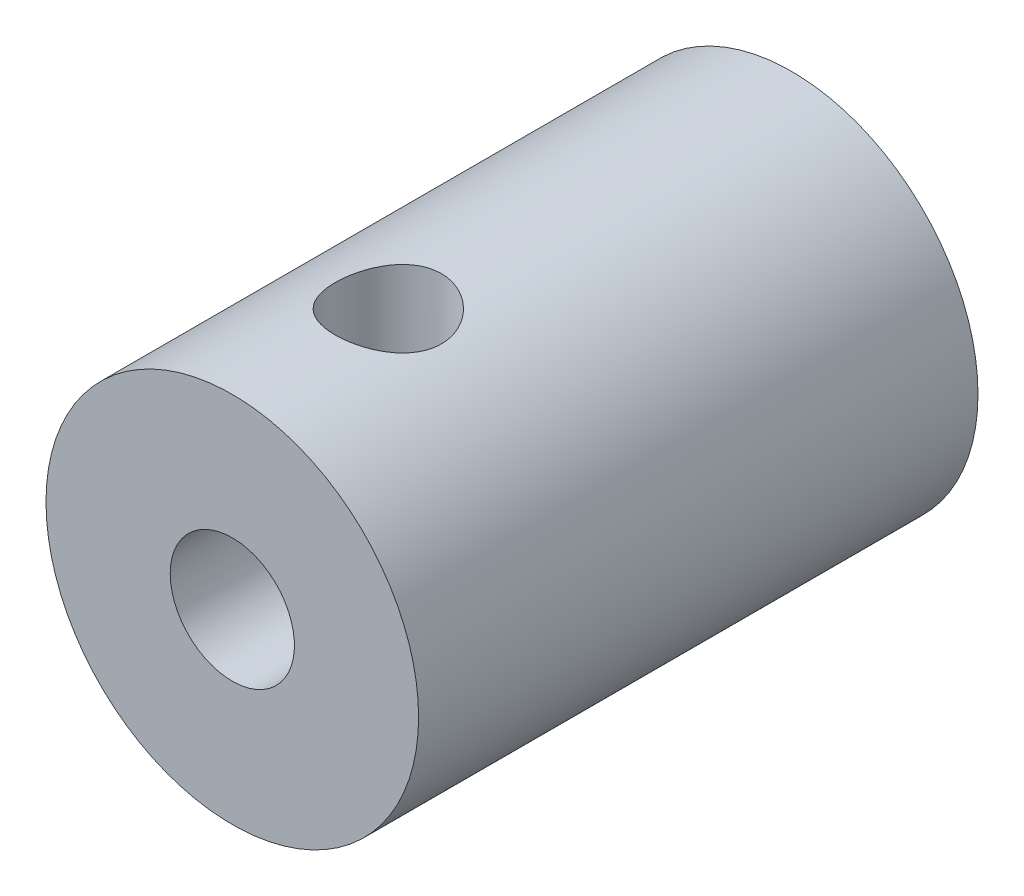
ISO-10303-21;
HEADER;
FILE_DESCRIPTION(('STEP AP214'),'2;1');
FILE_NAME('part.step','',(''),(''),'','','');
FILE_SCHEMA(('AUTOMOTIVE_DESIGN { 1 0 10303 214 1 1 1 1 }'));
ENDSEC;
DATA;
#1=APPLICATION_CONTEXT('core data for automotive mechanical design processes');
#2=APPLICATION_PROTOCOL_DEFINITION('international standard','automotive_design',2000,#1);
#3=PRODUCT_CONTEXT('',#1,'mechanical');
#4=PRODUCT('Part','Part','',(#3));
#5=PRODUCT_RELATED_PRODUCT_CATEGORY('part','',(#4));
#6=PRODUCT_DEFINITION_FORMATION('','',#4);
#7=PRODUCT_DEFINITION_CONTEXT('part definition',#1,'design');
#8=PRODUCT_DEFINITION('design','',#6,#7);
#9=PRODUCT_DEFINITION_SHAPE('','',#8);
#10=(LENGTH_UNIT() NAMED_UNIT(*) SI_UNIT(.MILLI.,.METRE.));
#11=(NAMED_UNIT(*) PLANE_ANGLE_UNIT() SI_UNIT($,.RADIAN.));
#12=(NAMED_UNIT(*) SI_UNIT($,.STERADIAN.) SOLID_ANGLE_UNIT());
#13=UNCERTAINTY_MEASURE_WITH_UNIT(LENGTH_MEASURE(1.E-05),#10,'distance_accuracy_value','');
#14=(GEOMETRIC_REPRESENTATION_CONTEXT(3) GLOBAL_UNCERTAINTY_ASSIGNED_CONTEXT((#13)) GLOBAL_UNIT_ASSIGNED_CONTEXT((#10,
#11,#12)) REPRESENTATION_CONTEXT('',''));
#15=CARTESIAN_POINT('',(0.,0.,0.));
#16=DIRECTION('',(0.,0.,1.));
#17=DIRECTION('',(1.,0.,0.));
#18=AXIS2_PLACEMENT_3D('',#15,#16,#17);
#19=CARTESIAN_POINT('',(0.,0.,14.3002));
#20=DIRECTION('',(0.,0.,-1.));
#21=DIRECTION('',(-1.,0.,0.));
#22=AXIS2_PLACEMENT_3D('',#19,#20,#21);
#23=CYLINDRICAL_SURFACE('',#22,1.5875);
#24=CARTESIAN_POINT('',(0.,-1.5875,11.6713));
#25=CARTESIAN_POINT('',(-0.0640084504905558,-1.58749589459133,11.6712958127309));
#26=CARTESIAN_POINT('',(-0.128052378170848,-1.58359361221242,11.6667427239407));
#27=CARTESIAN_POINT('',(-0.254004444384052,-1.56833557661519,11.6488693187214));
#28=CARTESIAN_POINT('',(-0.31591034239439,-1.55697224007382,11.6355400822862));
#29=CARTESIAN_POINT('',(-0.43545788852067,-1.52784070258027,11.6011333320459));
#30=CARTESIAN_POINT('',(-0.493123421246892,-1.51011232303287,11.5801039763453));
#31=CARTESIAN_POINT('',(-0.603563016370308,-1.46946883255929,11.5314038275147));
#32=CARTESIAN_POINT('',(-0.65633553057509,-1.44655208783111,11.5037309421891));
#33=CARTESIAN_POINT('',(-0.775479643972469,-1.38734547457949,11.431228393187));
#34=CARTESIAN_POINT('',(-0.839430121361419,-1.34927820132004,11.3838705313084));
#35=CARTESIAN_POINT('',(-0.956827927030479,-1.26875200121344,11.2805112899162));
#36=CARTESIAN_POINT('',(-1.01024616623841,-1.22628139243691,11.2244867137964));
#37=CARTESIAN_POINT('',(-1.10756916055087,-1.13919610828915,11.1036329469231));
#38=CARTESIAN_POINT('',(-1.15125855043728,-1.09455540189057,11.038647982042));
#39=CARTESIAN_POINT('',(-1.20839293207449,-1.02994020129173,10.9352453305035));
#40=CARTESIAN_POINT('',(-1.22602936162688,-1.00880526960526,10.8998142641661));
#41=CARTESIAN_POINT('',(-1.25840811877496,-0.968110362824358,10.8268057058711));
#42=CARTESIAN_POINT('',(-1.27315278956988,-0.948549120210561,10.7892299838775));
#43=CARTESIAN_POINT('',(-1.30030535020041,-0.911004554982558,10.7095011315517));
#44=CARTESIAN_POINT('',(-1.31252904950507,-0.893177658887615,10.6672089693406));
#45=CARTESIAN_POINT('',(-1.3330336869221,-0.862277496051067,10.5800335348547));
#46=CARTESIAN_POINT('',(-1.34132279892616,-0.849194387826297,10.5351558534305));
#47=CARTESIAN_POINT('',(-1.35346399193291,-0.829718778233447,10.4425763800295));
#48=CARTESIAN_POINT('',(-1.35724831461928,-0.823428578671972,10.3948425336665));
#49=CARTESIAN_POINT('',(-1.35967715414612,-0.819416815431586,10.2988983855038));
#50=CARTESIAN_POINT('',(-1.35832678712271,-0.821686722558324,10.2506886056781));
#51=CARTESIAN_POINT('',(-1.3512739801,-0.833213054748677,10.1630454067824));
#52=CARTESIAN_POINT('',(-1.34626586930141,-0.841352481635303,10.1233938189834));
#53=CARTESIAN_POINT('',(-1.3330747561935,-0.862102484627274,10.0458069526178));
#54=CARTESIAN_POINT('',(-1.32488626617737,-0.874720785718706,10.007874767888));
#55=CARTESIAN_POINT('',(-1.29777622467968,-0.91481806217253,9.90342216849849));
#56=CARTESIAN_POINT('',(-1.27557728239548,-0.945959990673267,9.8391840292266));
#57=CARTESIAN_POINT('',(-1.22317046070292,-1.01283679367527,9.7166460783179));
#58=CARTESIAN_POINT('',(-1.19293820130944,-1.04858547600138,9.65836510420953));
#59=CARTESIAN_POINT('',(-1.12216109506704,-1.12419073896514,9.54278538980588));
#60=CARTESIAN_POINT('',(-1.08098529702561,-1.16414732702571,9.48593715593545));
#61=CARTESIAN_POINT('',(-0.989845756287439,-1.2425690540304,9.37872205247443));
#62=CARTESIAN_POINT('',(-0.939892243937295,-1.28103586628618,9.3283477546308));
#63=CARTESIAN_POINT('',(-0.834150799346787,-1.35210097812726,9.23751445515691));
#64=CARTESIAN_POINT('',(-0.778849609273434,-1.38490773733558,9.19665692022532));
#65=CARTESIAN_POINT('',(-0.660526806227747,-1.44507822711164,9.12279442899352));
#66=CARTESIAN_POINT('',(-0.597512689657164,-1.47244717600585,9.08978193827052));
#67=CARTESIAN_POINT('',(-0.476303309747889,-1.5154778394623,9.03831708605576));
#68=CARTESIAN_POINT('',(-0.419195857618796,-1.53235030667584,9.01832748246568));
#69=CARTESIAN_POINT('',(-0.301411762969124,-1.55979290959103,8.98594556501144));
#70=CARTESIAN_POINT('',(-0.240737764634567,-1.57036765117261,8.97354769869642));
#71=CARTESIAN_POINT('',(-0.117156057800018,-1.58439653382545,8.95711999102989));
#72=CARTESIAN_POINT('',(-0.0542395964092401,-1.58781871755521,8.95312770489127));
#73=CARTESIAN_POINT('',(0.0714976367282692,-1.58713437817949,8.95392708996004));
#74=CARTESIAN_POINT('',(0.134318410856156,-1.58302804558713,8.95871853889035));
#75=CARTESIAN_POINT('',(0.253393528607964,-1.56821346156491,8.97607493754793));
#76=CARTESIAN_POINT('',(0.309796808389616,-1.55799646830022,8.98806167137502));
#77=CARTESIAN_POINT('',(0.419460262510755,-1.53211827479266,9.01860522171979));
#78=CARTESIAN_POINT('',(0.472719944416459,-1.51645622423393,9.03716306440915));
#79=CARTESIAN_POINT('',(0.579486540550051,-1.47912502022405,9.08177981424115));
#80=CARTESIAN_POINT('',(0.632647717425507,-1.45706543034463,9.108333131018));
#81=CARTESIAN_POINT('',(0.733720870068728,-1.4088832597255,9.16711084410029));
#82=CARTESIAN_POINT('',(0.781628630163251,-1.38275745608468,9.19933974158627));
#83=CARTESIAN_POINT('',(0.894720285326069,-1.31375589481025,9.28604087051777));
#84=CARTESIAN_POINT('',(0.956477460615478,-1.26906359315812,9.34354877195222));
#85=CARTESIAN_POINT('',(1.0677494630227,-1.17698022010064,9.4677070934192));
#86=CARTESIAN_POINT('',(1.11723724811169,-1.1295834657236,9.53437721363313));
#87=CARTESIAN_POINT('',(1.19351749671388,-1.04786085051356,9.65960358984201));
#88=CARTESIAN_POINT('',(1.22290828097926,-1.01310863453805,9.71631504139277));
#89=CARTESIAN_POINT('',(1.27406536320765,-0.947949175840945,9.83537755047493));
#90=CARTESIAN_POINT('',(1.29585426247341,-0.917529215212046,9.89771118491842));
#91=CARTESIAN_POINT('',(1.32402059627502,-0.87607254910584,10.0036477947715));
#92=CARTESIAN_POINT('',(1.33310694240689,-0.862066481648083,10.0453397515935));
#93=CARTESIAN_POINT('',(1.3474026932412,-0.839548365865379,10.1307900240933));
#94=CARTESIAN_POINT('',(1.35262202963345,-0.831022250833542,10.1745427372041));
#95=CARTESIAN_POINT('',(1.35876313025869,-0.820951006491957,10.2636362550801));
#96=CARTESIAN_POINT('',(1.35964220113738,-0.819475232969577,10.3089884337188));
#97=CARTESIAN_POINT('',(1.35687863818691,-0.824039148789004,10.3991865057367));
#98=CARTESIAN_POINT('',(1.35323144607264,-0.83008641440837,10.4440318427637));
#99=CARTESIAN_POINT('',(1.34067637600014,-0.850237335459248,10.5404566560591));
#100=CARTESIAN_POINT('',(1.33087333584442,-0.865693932124668,10.5916213509243));
#101=CARTESIAN_POINT('',(1.30622154024598,-0.902456395548841,10.6905731795525));
#102=CARTESIAN_POINT('',(1.29135486175709,-0.923782987325061,10.7383475771669));
#103=CARTESIAN_POINT('',(1.26002710676671,-0.96595144753542,10.8229106889895));
#104=CARTESIAN_POINT('',(1.24423605751177,-0.986290454008599,10.860209756448));
#105=CARTESIAN_POINT('',(1.20974843424541,-1.02830258738565,10.932664280368));
#106=CARTESIAN_POINT('',(1.19105003626277,-1.04997654660314,10.9678183717342));
#107=CARTESIAN_POINT('',(1.13069673840227,-1.11589279748126,11.07031686126));
#108=CARTESIAN_POINT('',(1.08479820919116,-1.16100863868931,11.1346592807031));
#109=CARTESIAN_POINT('',(0.97943587426016,-1.25137093830487,11.2580173213044));
#110=CARTESIAN_POINT('',(0.919440875611505,-1.29652607090841,11.3166465455703));
#111=CARTESIAN_POINT('',(0.787143942101332,-1.38082214260056,11.4233379251849));
#112=CARTESIAN_POINT('',(0.714877805812195,-1.41997996297702,11.4714299117493));
#113=CARTESIAN_POINT('',(0.583235904430114,-1.47764390080102,11.5412760035947));
#114=CARTESIAN_POINT('',(0.526881409566862,-1.49878058294293,11.5665651021109));
#115=CARTESIAN_POINT('',(0.409550647271624,-1.53498276788059,11.6096133296628));
#116=CARTESIAN_POINT('',(0.348582333889017,-1.5500584485316,11.627385084735));
#117=CARTESIAN_POINT('',(0.239567673912469,-1.57003245311106,11.6508623260936));
#118=CARTESIAN_POINT('',(0.192224956350628,-1.57655031756783,11.6584946667913));
#119=CARTESIAN_POINT('',(0.0965949608552555,-1.58528586659189,11.6687153493739));
#120=CARTESIAN_POINT('',(0.0483075840061865,-1.58750309837799,11.6713031601585));
#121=CARTESIAN_POINT('',(0.,-1.5875,11.6713));
#122=B_SPLINE_CURVE_WITH_KNOTS('',3,(#24,#25,#26,#27,#28,#29,#30,#31,#32,#33,#34,#35,#36,#37,
#38,#39,#40,#41,#42,#43,#44,#45,#46,#47,#48,#49,#50,#51,#52,#53,#54,#55,#56,#57,#58,#59,#60,#61,
#62,#63,#64,#65,#66,#67,#68,#69,#70,#71,#72,#73,#74,#75,#76,#77,#78,#79,#80,#81,#82,#83,#84,#85,
#86,#87,#88,#89,#90,#91,#92,#93,#94,#95,#96,#97,#98,#99,#100,#101,#102,#103,#104,#105,#106,#107,
#108,#109,#110,#111,#112,#113,#114,#115,#116,#117,#118,#119,#120,#121),.UNSPECIFIED.,.T.,.F.,(4,
2,2,2,2,2,2,2,2,2,2,2,2,2,2,2,2,2,2,2,2,2,2,2,2,2,2,2,2,2,2,2,2,2,2,2,2,2,2,2,2,2,2,2,2,2,2,2,
4),(0.,0.191819070193151,0.383833405340433,0.574666802483425,0.76556037633045,1.02876556970795,
1.29268783032967,1.56197287161722,1.69644721660348,1.83081214236432,1.97293887195886,
2.11476903455327,2.25870660067517,2.40250078693054,2.52438949382207,2.64648945934396,
2.86950106145086,3.09319735934307,3.33476611409664,3.57605516781693,3.80376118121025,
4.03124761261003,4.21890672322055,4.40642841911626,4.59478617885752,4.78313917217131,
4.95807134920853,5.13303085643881,5.32249879781938,5.51211768446107,5.79708739754358,
6.08267971605064,6.30030781167958,6.51728324622822,6.65159868143531,6.78556794531423,
6.92085241842386,7.05627324373468,7.2183844025825,7.38107543147492,7.51686726565472,
7.6527446373059,7.92463540426726,8.2091589064312,8.49286619739085,8.68798293153917,
8.88277063611259,9.02752246733836,9.17228953756625),.UNSPECIFIED.);
#123=CARTESIAN_POINT('',(0.,-1.5875,11.6713));
#124=VERTEX_POINT('',#123);
#125=EDGE_CURVE('E75',#124,#124,#122,.T.);
#126=ORIENTED_EDGE('',*,*,#125,.T.);
#127=EDGE_LOOP('',(#126));
#128=FACE_BOUND('',#127,.T.);
#129=CARTESIAN_POINT('',(0.,1.5875,11.6713));
#130=CARTESIAN_POINT('',(0.0640084504905558,1.58749589459133,11.6712958127309));
#131=CARTESIAN_POINT('',(0.128052378170848,1.58359361221242,11.6667427239407));
#132=CARTESIAN_POINT('',(0.254004444384052,1.56833557661519,11.6488693187214));
#133=CARTESIAN_POINT('',(0.31591034239439,1.55697224007382,11.6355400822862));
#134=CARTESIAN_POINT('',(0.43545788852067,1.52784070258027,11.6011333320459));
#135=CARTESIAN_POINT('',(0.493123421246892,1.51011232303287,11.5801039763453));
#136=CARTESIAN_POINT('',(0.603563016370308,1.46946883255929,11.5314038275147));
#137=CARTESIAN_POINT('',(0.65633553057509,1.44655208783111,11.5037309421891));
#138=CARTESIAN_POINT('',(0.775479643972469,1.38734547457949,11.431228393187));
#139=CARTESIAN_POINT('',(0.839430121361419,1.34927820132004,11.3838705313084));
#140=CARTESIAN_POINT('',(0.956827927030479,1.26875200121344,11.2805112899162));
#141=CARTESIAN_POINT('',(1.01024616623841,1.22628139243691,11.2244867137964));
#142=CARTESIAN_POINT('',(1.10756916055087,1.13919610828915,11.1036329469231));
#143=CARTESIAN_POINT('',(1.15125855043728,1.09455540189057,11.038647982042));
#144=CARTESIAN_POINT('',(1.20839293207449,1.02994020129173,10.9352453305035));
#145=CARTESIAN_POINT('',(1.22602936162688,1.00880526960526,10.8998142641661));
#146=CARTESIAN_POINT('',(1.25840811877496,0.968110362824358,10.8268057058711));
#147=CARTESIAN_POINT('',(1.27315278956988,0.948549120210561,10.7892299838775));
#148=CARTESIAN_POINT('',(1.30030535020041,0.911004554982558,10.7095011315517));
#149=CARTESIAN_POINT('',(1.31252904950507,0.893177658887615,10.6672089693406));
#150=CARTESIAN_POINT('',(1.3330336869221,0.862277496051067,10.5800335348547));
#151=CARTESIAN_POINT('',(1.34132279892616,0.849194387826297,10.5351558534305));
#152=CARTESIAN_POINT('',(1.35346399193291,0.829718778233447,10.4425763800295));
#153=CARTESIAN_POINT('',(1.35724831461928,0.823428578671972,10.3948425336665));
#154=CARTESIAN_POINT('',(1.35967715414612,0.819416815431586,10.2988983855038));
#155=CARTESIAN_POINT('',(1.35832678712271,0.821686722558324,10.2506886056781));
#156=CARTESIAN_POINT('',(1.3512739801,0.833213054748677,10.1630454067824));
#157=CARTESIAN_POINT('',(1.34626586930141,0.841352481635303,10.1233938189834));
#158=CARTESIAN_POINT('',(1.3330747561935,0.862102484627274,10.0458069526178));
#159=CARTESIAN_POINT('',(1.32488626617737,0.874720785718706,10.007874767888));
#160=CARTESIAN_POINT('',(1.29777622467968,0.91481806217253,9.90342216849849));
#161=CARTESIAN_POINT('',(1.27557728239548,0.945959990673267,9.8391840292266));
#162=CARTESIAN_POINT('',(1.22317046070292,1.01283679367527,9.7166460783179));
#163=CARTESIAN_POINT('',(1.19293820130944,1.04858547600138,9.65836510420953));
#164=CARTESIAN_POINT('',(1.12216109506704,1.12419073896514,9.54278538980588));
#165=CARTESIAN_POINT('',(1.08098529702561,1.16414732702571,9.48593715593545));
#166=CARTESIAN_POINT('',(0.989845756287439,1.2425690540304,9.37872205247443));
#167=CARTESIAN_POINT('',(0.939892243937295,1.28103586628618,9.3283477546308));
#168=CARTESIAN_POINT('',(0.834150799346787,1.35210097812726,9.23751445515691));
#169=CARTESIAN_POINT('',(0.778849609273434,1.38490773733558,9.19665692022532));
#170=CARTESIAN_POINT('',(0.660526806227747,1.44507822711164,9.12279442899352));
#171=CARTESIAN_POINT('',(0.597512689657164,1.47244717600585,9.08978193827052));
#172=CARTESIAN_POINT('',(0.476303309747889,1.5154778394623,9.03831708605576));
#173=CARTESIAN_POINT('',(0.419195857618796,1.53235030667584,9.01832748246568));
#174=CARTESIAN_POINT('',(0.301411762969124,1.55979290959103,8.98594556501144));
#175=CARTESIAN_POINT('',(0.240737764634567,1.57036765117261,8.97354769869642));
#176=CARTESIAN_POINT('',(0.117156057800018,1.58439653382545,8.95711999102989));
#177=CARTESIAN_POINT('',(0.0542395964092401,1.58781871755521,8.95312770489127));
#178=CARTESIAN_POINT('',(-0.0714976367282692,1.58713437817949,8.95392708996004));
#179=CARTESIAN_POINT('',(-0.134318410856156,1.58302804558713,8.95871853889035));
#180=CARTESIAN_POINT('',(-0.253393528607964,1.56821346156491,8.97607493754793));
#181=CARTESIAN_POINT('',(-0.309796808389616,1.55799646830022,8.98806167137502));
#182=CARTESIAN_POINT('',(-0.419460262510755,1.53211827479266,9.01860522171979));
#183=CARTESIAN_POINT('',(-0.472719944416459,1.51645622423393,9.03716306440915));
#184=CARTESIAN_POINT('',(-0.579486540550051,1.47912502022405,9.08177981424115));
#185=CARTESIAN_POINT('',(-0.632647717425507,1.45706543034463,9.108333131018));
#186=CARTESIAN_POINT('',(-0.733720870068728,1.4088832597255,9.16711084410029));
#187=CARTESIAN_POINT('',(-0.781628630163251,1.38275745608468,9.19933974158627));
#188=CARTESIAN_POINT('',(-0.894720285326069,1.31375589481025,9.28604087051777));
#189=CARTESIAN_POINT('',(-0.956477460615478,1.26906359315812,9.34354877195222));
#190=CARTESIAN_POINT('',(-1.0677494630227,1.17698022010064,9.4677070934192));
#191=CARTESIAN_POINT('',(-1.11723724811169,1.1295834657236,9.53437721363313));
#192=CARTESIAN_POINT('',(-1.19351749671388,1.04786085051356,9.65960358984201));
#193=CARTESIAN_POINT('',(-1.22290828097926,1.01310863453805,9.71631504139277));
#194=CARTESIAN_POINT('',(-1.27406536320765,0.947949175840945,9.83537755047493));
#195=CARTESIAN_POINT('',(-1.29585426247341,0.917529215212046,9.89771118491842));
#196=CARTESIAN_POINT('',(-1.32402059627502,0.87607254910584,10.0036477947715));
#197=CARTESIAN_POINT('',(-1.33310694240689,0.862066481648083,10.0453397515935));
#198=CARTESIAN_POINT('',(-1.3474026932412,0.839548365865379,10.1307900240933));
#199=CARTESIAN_POINT('',(-1.35262202963345,0.831022250833542,10.1745427372041));
#200=CARTESIAN_POINT('',(-1.35876313025869,0.820951006491957,10.2636362550801));
#201=CARTESIAN_POINT('',(-1.35964220113738,0.819475232969577,10.3089884337188));
#202=CARTESIAN_POINT('',(-1.35687863818691,0.824039148789004,10.3991865057367));
#203=CARTESIAN_POINT('',(-1.35323144607264,0.83008641440837,10.4440318427637));
#204=CARTESIAN_POINT('',(-1.34067637600014,0.850237335459248,10.5404566560591));
#205=CARTESIAN_POINT('',(-1.33087333584442,0.865693932124668,10.5916213509243));
#206=CARTESIAN_POINT('',(-1.30622154024598,0.902456395548841,10.6905731795525));
#207=CARTESIAN_POINT('',(-1.29135486175709,0.923782987325061,10.7383475771669));
#208=CARTESIAN_POINT('',(-1.26002710676671,0.96595144753542,10.8229106889895));
#209=CARTESIAN_POINT('',(-1.24423605751177,0.986290454008599,10.860209756448));
#210=CARTESIAN_POINT('',(-1.20974843424541,1.02830258738565,10.932664280368));
#211=CARTESIAN_POINT('',(-1.19105003626277,1.04997654660314,10.9678183717342));
#212=CARTESIAN_POINT('',(-1.13069673840227,1.11589279748126,11.07031686126));
#213=CARTESIAN_POINT('',(-1.08479820919116,1.16100863868931,11.1346592807031));
#214=CARTESIAN_POINT('',(-0.97943587426016,1.25137093830487,11.2580173213044));
#215=CARTESIAN_POINT('',(-0.919440875611505,1.29652607090841,11.3166465455703));
#216=CARTESIAN_POINT('',(-0.787143942101332,1.38082214260056,11.4233379251849));
#217=CARTESIAN_POINT('',(-0.714877805812195,1.41997996297702,11.4714299117493));
#218=CARTESIAN_POINT('',(-0.583235904430114,1.47764390080102,11.5412760035947));
#219=CARTESIAN_POINT('',(-0.526881409566862,1.49878058294293,11.5665651021109));
#220=CARTESIAN_POINT('',(-0.409550647271624,1.53498276788059,11.6096133296628));
#221=CARTESIAN_POINT('',(-0.348582333889017,1.5500584485316,11.627385084735));
#222=CARTESIAN_POINT('',(-0.239567673912469,1.57003245311106,11.6508623260936));
#223=CARTESIAN_POINT('',(-0.192224956350628,1.57655031756783,11.6584946667913));
#224=CARTESIAN_POINT('',(-0.0965949608552555,1.58528586659189,11.6687153493739));
#225=CARTESIAN_POINT('',(-0.0483075840061865,1.58750309837799,11.6713031601585));
#226=CARTESIAN_POINT('',(0.,1.5875,11.6713));
#227=B_SPLINE_CURVE_WITH_KNOTS('',3,(#129,#130,#131,#132,#133,#134,#135,#136,#137,#138,#139,
#140,#141,#142,#143,#144,#145,#146,#147,#148,#149,#150,#151,#152,#153,#154,#155,#156,#157,#158,
#159,#160,#161,#162,#163,#164,#165,#166,#167,#168,#169,#170,#171,#172,#173,#174,#175,#176,#177,
#178,#179,#180,#181,#182,#183,#184,#185,#186,#187,#188,#189,#190,#191,#192,#193,#194,#195,#196,
#197,#198,#199,#200,#201,#202,#203,#204,#205,#206,#207,#208,#209,#210,#211,#212,#213,#214,#215,
#216,#217,#218,#219,#220,#221,#222,#223,#224,#225,#226),.UNSPECIFIED.,.T.,.F.,(4,2,2,2,2,2,2,2,
2,2,2,2,2,2,2,2,2,2,2,2,2,2,2,2,2,2,2,2,2,2,2,2,2,2,2,2,2,2,2,2,2,2,2,2,2,2,2,2,4),(0.,
0.191819070193151,0.383833405340433,0.574666802483425,0.76556037633045,1.02876556970795,
1.29268783032967,1.56197287161722,1.69644721660348,1.83081214236432,1.97293887195886,
2.11476903455327,2.25870660067517,2.40250078693054,2.52438949382207,2.64648945934396,
2.86950106145086,3.09319735934307,3.33476611409664,3.57605516781693,3.80376118121025,
4.03124761261003,4.21890672322055,4.40642841911626,4.59478617885752,4.78313917217131,
4.95807134920853,5.13303085643881,5.32249879781938,5.51211768446107,5.79708739754358,
6.08267971605064,6.30030781167958,6.51728324622822,6.65159868143531,6.78556794531423,
6.92085241842386,7.05627324373468,7.2183844025825,7.38107543147492,7.51686726565472,
7.6527446373059,7.92463540426726,8.2091589064312,8.49286619739085,8.68798293153917,
8.88277063611259,9.02752246733836,9.17228953756625),.UNSPECIFIED.);
#228=CARTESIAN_POINT('',(0.,1.5875,11.6713));
#229=VERTEX_POINT('',#228);
#230=EDGE_CURVE('E69',#229,#229,#227,.T.);
#231=ORIENTED_EDGE('',*,*,#230,.T.);
#232=EDGE_LOOP('',(#231));
#233=FACE_BOUND('',#232,.T.);
#234=CARTESIAN_POINT('',(0.,0.,14.3002));
#235=DIRECTION('',(0.,0.,-1.));
#236=DIRECTION('',(-1.,0.,0.));
#237=AXIS2_PLACEMENT_3D('',#234,#235,#236);
#238=CIRCLE('',#237,1.5875);
#239=CARTESIAN_POINT('',(-1.5875,0.,14.3002));
#240=VERTEX_POINT('',#239);
#241=EDGE_CURVE('E103',#240,#240,#238,.T.);
#242=ORIENTED_EDGE('',*,*,#241,.F.);
#243=EDGE_LOOP('',(#242));
#244=FACE_BOUND('',#243,.T.);
#245=CARTESIAN_POINT('',(0.,0.,6.35));
#246=DIRECTION('',(0.,0.,-1.));
#247=DIRECTION('',(-1.,0.,0.));
#248=AXIS2_PLACEMENT_3D('',#245,#246,#247);
#249=CIRCLE('',#248,1.5875);
#250=CARTESIAN_POINT('',(-1.5875,0.,6.35));
#251=VERTEX_POINT('',#250);
#252=EDGE_CURVE('E109',#251,#251,#249,.T.);
#253=ORIENTED_EDGE('',*,*,#252,.T.);
#254=EDGE_LOOP('',(#253));
#255=FACE_BOUND('',#254,.T.);
#256=ADVANCED_FACE('F30',(#128,#233,#244,#255),#23,.F.);
#257=CARTESIAN_POINT('',(0.,0.,14.3002));
#258=DIRECTION('',(0.,0.,-1.));
#259=DIRECTION('',(-1.,0.,0.));
#260=AXIS2_PLACEMENT_3D('',#257,#258,#259);
#261=CYLINDRICAL_SURFACE('',#260,4.7625);
#262=CARTESIAN_POINT('',(0.,-4.7625,11.6713));
#263=CARTESIAN_POINT('',(0.0747130529778893,-4.76249910615411,11.671298671976));
#264=CARTESIAN_POINT('',(0.149439770560647,-4.76072484176044,11.6651178104309));
#265=CARTESIAN_POINT('',(0.29672763904972,-4.75381979521839,11.6406095451125));
#266=CARTESIAN_POINT('',(0.369287954910806,-4.74868773582743,11.6222775192282));
#267=CARTESIAN_POINT('',(0.510096647559026,-4.73563130773512,11.5741211216186));
#268=CARTESIAN_POINT('',(0.578350873706299,-4.72771082749983,11.5443127483235));
#269=CARTESIAN_POINT('',(0.708892135043702,-4.70990700954045,11.474112593486));
#270=CARTESIAN_POINT('',(0.771178549527406,-4.70002346796803,11.4337197126874));
#271=CARTESIAN_POINT('',(0.889649651730131,-4.67906373955544,11.3423797925316));
#272=CARTESIAN_POINT('',(0.945655610055491,-4.66796490800477,11.2912061362912));
#273=CARTESIAN_POINT('',(1.0484184909622,-4.64596516914378,11.1802409117405));
#274=CARTESIAN_POINT('',(1.09517403095885,-4.63506429164082,11.120448057494));
#275=CARTESIAN_POINT('',(1.17901776862754,-4.61445881113563,10.9924684439848));
#276=CARTESIAN_POINT('',(1.21589352500811,-4.60478254947106,10.9241375198113));
#277=CARTESIAN_POINT('',(1.27755991315349,-4.5880578689383,10.7819241474718));
#278=CARTESIAN_POINT('',(1.30235313696768,-4.58100888651983,10.7080428939391));
#279=CARTESIAN_POINT('',(1.33851692730094,-4.57057187087897,10.5588210575646));
#280=CARTESIAN_POINT('',(1.35021458589323,-4.56709481286359,10.4835661318741));
#281=CARTESIAN_POINT('',(1.36087589799455,-4.56392995914291,10.3320878156901));
#282=CARTESIAN_POINT('',(1.35984231028366,-4.56424134250628,10.2558646385866));
#283=CARTESIAN_POINT('',(1.34532862879658,-4.56853893279477,10.1072239317419));
#284=CARTESIAN_POINT('',(1.33225183347416,-4.57240605959699,10.0347630201825));
#285=CARTESIAN_POINT('',(1.29467196470204,-4.58318766064072,9.89310929430149));
#286=CARTESIAN_POINT('',(1.27016786074857,-4.59010240971079,9.82391677534031));
#287=CARTESIAN_POINT('',(1.21011778079943,-4.60629950381668,9.68974828380762));
#288=CARTESIAN_POINT('',(1.17443624887876,-4.6156106498115,9.62483660696924));
#289=CARTESIAN_POINT('',(1.09313853115981,-4.63553682583539,9.50178401189799));
#290=CARTESIAN_POINT('',(1.04752013887183,-4.64615214522885,9.44364460186131));
#291=CARTESIAN_POINT('',(0.945613808374621,-4.66797933994029,9.33349161037857));
#292=CARTESIAN_POINT('',(0.888989324200014,-4.67919864201871,9.28179035879976));
#293=CARTESIAN_POINT('',(0.767734854711599,-4.70061425563702,9.18854872602479));
#294=CARTESIAN_POINT('',(0.703104456973554,-4.71081051442586,9.14700886862053));
#295=CARTESIAN_POINT('',(0.567143378034055,-4.72910979837591,9.075103586628));
#296=CARTESIAN_POINT('',(0.495777409782721,-4.7372008583588,9.04480163718408));
#297=CARTESIAN_POINT('',(0.348679021038379,-4.75029187375806,8.99671940415858));
#298=CARTESIAN_POINT('',(0.27294770327371,-4.75529260611158,8.97893597314828));
#299=CARTESIAN_POINT('',(0.121928159085002,-4.7615190609649,8.95690209326221));
#300=CARTESIAN_POINT('',(0.0467065564677244,-4.76286298156602,8.95222776374153));
#301=CARTESIAN_POINT('',(-0.103448322015912,-4.76196800761694,8.95536462321627));
#302=CARTESIAN_POINT('',(-0.178381631303093,-4.7597295417235,8.96317431841361));
#303=CARTESIAN_POINT('',(-0.324272411558481,-4.75199826556877,8.99071236754281));
#304=CARTESIAN_POINT('',(-0.395279512238859,-4.74657173442845,9.01019813863549));
#305=CARTESIAN_POINT('',(-0.533005492039659,-4.73308606280186,9.06024797216756));
#306=CARTESIAN_POINT('',(-0.599723874762198,-4.72502661822315,9.09081331430395));
#307=CARTESIAN_POINT('',(-0.72857800326758,-4.70690007925331,9.16289970410737));
#308=CARTESIAN_POINT('',(-0.790583580364398,-4.69679336748189,9.20464320620641));
#309=CARTESIAN_POINT('',(-0.906856321261831,-4.67573685565677,9.29762655338169));
#310=CARTESIAN_POINT('',(-0.96112172450521,-4.66478686466267,9.34886855288264));
#311=CARTESIAN_POINT('',(-1.06220467816608,-4.64283250450958,9.46138111638906));
#312=CARTESIAN_POINT('',(-1.10872158995048,-4.63183800989465,9.52292425561314));
#313=CARTESIAN_POINT('',(-1.19078217067452,-4.61142480451941,9.65318002238218));
#314=CARTESIAN_POINT('',(-1.22632622343521,-4.60200603864677,9.72189239904095));
#315=CARTESIAN_POINT('',(-1.28517268145781,-4.58592072488041,9.86424967682684));
#316=CARTESIAN_POINT('',(-1.30854012713244,-4.5792395959238,9.93786595207722));
#317=CARTESIAN_POINT('',(-1.34249121008744,-4.56940281032297,10.0882106631389));
#318=CARTESIAN_POINT('',(-1.35307870810188,-4.56624608900115,10.164938151831));
#319=CARTESIAN_POINT('',(-1.36092455040578,-4.56391335454089,10.3162252824675));
#320=CARTESIAN_POINT('',(-1.35866970788407,-4.56459194886419,10.3907577870737));
#321=CARTESIAN_POINT('',(-1.3420420529431,-4.5695079526439,10.5383329044818));
#322=CARTESIAN_POINT('',(-1.32766964286741,-4.5737452439397,10.611375566669));
#323=CARTESIAN_POINT('',(-1.28751515000952,-4.58520849858504,10.7531851097254));
#324=CARTESIAN_POINT('',(-1.26185029178566,-4.59240370727278,10.821987849387));
#325=CARTESIAN_POINT('',(-1.19993011119005,-4.60896913868397,10.9543650535867));
#326=CARTESIAN_POINT('',(-1.16367291868063,-4.61833974542644,11.0179385923371));
#327=CARTESIAN_POINT('',(-1.0801812993991,-4.63858981495493,11.1403414263751));
#328=CARTESIAN_POINT('',(-1.03262149419702,-4.64950913599081,11.1989421984965));
#329=CARTESIAN_POINT('',(-0.928475317194594,-4.67142023258268,11.3074890451587));
#330=CARTESIAN_POINT('',(-0.871886677332633,-4.6824120256769,11.3574329384794));
#331=CARTESIAN_POINT('',(-0.749545117737118,-4.70356613921108,11.4485134167292));
#332=CARTESIAN_POINT('',(-0.683594906488908,-4.71370007221688,11.4893922168012));
#333=CARTESIAN_POINT('',(-0.545468955126888,-4.73167059506192,11.559420751589));
#334=CARTESIAN_POINT('',(-0.473296655907666,-4.73950844425046,11.5885769191808));
#335=CARTESIAN_POINT('',(-0.334651372172606,-4.75116806432972,11.6311723440356));
#336=CARTESIAN_POINT('',(-0.26869022003419,-4.75538435031651,11.6461821693408));
#337=CARTESIAN_POINT('',(-0.135156295305952,-4.76105053847871,11.6662459359602));
#338=CARTESIAN_POINT('',(-0.0675837382544703,-4.76250080855278,11.6713012013004));
#339=CARTESIAN_POINT('',(0.,-4.7625,11.6713));
#340=B_SPLINE_CURVE_WITH_KNOTS('',3,(#262,#263,#264,#265,#266,#267,#268,#269,#270,#271,#272,
#273,#274,#275,#276,#277,#278,#279,#280,#281,#282,#283,#284,#285,#286,#287,#288,#289,#290,#291,
#292,#293,#294,#295,#296,#297,#298,#299,#300,#301,#302,#303,#304,#305,#306,#307,#308,#309,#310,
#311,#312,#313,#314,#315,#316,#317,#318,#319,#320,#321,#322,#323,#324,#325,#326,#327,#328,#329,
#330,#331,#332,#333,#334,#335,#336,#337,#338,#339),.UNSPECIFIED.,.T.,.F.,(4,2,2,2,2,2,2,2,2,2,2,
2,2,2,2,2,2,2,2,2,2,2,2,2,2,2,2,2,2,2,2,2,2,2,2,2,2,2,4),(0.,0.223891093401415,
0.447867400348589,0.671532600450735,0.895221038562008,1.1241894540172,1.3531920657071,
1.58678251369103,1.82032282774805,2.04788987982158,2.27540762043045,2.49557293839875,
2.71575811450561,2.93872435402094,3.16174015397321,3.39313717400732,3.62454611940855,
3.85724291462337,4.08988118386984,4.3149052647879,4.53990242206693,4.7603796636648,
4.98088237863229,5.20614959447116,5.4314679674992,5.66413515523558,5.89679420355433,
6.12819744276731,6.35953075914808,6.58215477179628,6.80477139287778,7.02512967857782,
7.24552689333998,7.47326441045602,7.70105922603058,7.93467729979019,8.16816699845995,
8.3707207616397,8.57324758193209),.UNSPECIFIED.);
#341=CARTESIAN_POINT('',(0.,-4.7625,11.6713));
#342=VERTEX_POINT('',#341);
#343=EDGE_CURVE('E10',#342,#342,#340,.T.);
#344=ORIENTED_EDGE('',*,*,#343,.T.);
#345=EDGE_LOOP('',(#344));
#346=FACE_BOUND('',#345,.T.);
#347=CARTESIAN_POINT('',(0.,4.7625,11.6713));
#348=CARTESIAN_POINT('',(-0.0747130529778893,4.76249910615411,11.671298671976));
#349=CARTESIAN_POINT('',(-0.149439770560647,4.76072484176044,11.6651178104309));
#350=CARTESIAN_POINT('',(-0.29672763904972,4.75381979521839,11.6406095451125));
#351=CARTESIAN_POINT('',(-0.369287954910806,4.74868773582743,11.6222775192282));
#352=CARTESIAN_POINT('',(-0.510096647559026,4.73563130773512,11.5741211216186));
#353=CARTESIAN_POINT('',(-0.578350873706299,4.72771082749983,11.5443127483235));
#354=CARTESIAN_POINT('',(-0.708892135043702,4.70990700954045,11.474112593486));
#355=CARTESIAN_POINT('',(-0.771178549527406,4.70002346796803,11.4337197126874));
#356=CARTESIAN_POINT('',(-0.889649651730131,4.67906373955544,11.3423797925316));
#357=CARTESIAN_POINT('',(-0.945655610055491,4.66796490800477,11.2912061362912));
#358=CARTESIAN_POINT('',(-1.0484184909622,4.64596516914378,11.1802409117405));
#359=CARTESIAN_POINT('',(-1.09517403095885,4.63506429164082,11.120448057494));
#360=CARTESIAN_POINT('',(-1.17901776862754,4.61445881113563,10.9924684439848));
#361=CARTESIAN_POINT('',(-1.21589352500811,4.60478254947106,10.9241375198113));
#362=CARTESIAN_POINT('',(-1.27755991315349,4.5880578689383,10.7819241474718));
#363=CARTESIAN_POINT('',(-1.30235313696768,4.58100888651983,10.7080428939391));
#364=CARTESIAN_POINT('',(-1.33851692730094,4.57057187087897,10.5588210575646));
#365=CARTESIAN_POINT('',(-1.35021458589323,4.56709481286359,10.4835661318741));
#366=CARTESIAN_POINT('',(-1.36087589799455,4.56392995914291,10.3320878156901));
#367=CARTESIAN_POINT('',(-1.35984231028366,4.56424134250628,10.2558646385866));
#368=CARTESIAN_POINT('',(-1.34532862879658,4.56853893279477,10.1072239317419));
#369=CARTESIAN_POINT('',(-1.33225183347416,4.57240605959699,10.0347630201825));
#370=CARTESIAN_POINT('',(-1.29467196470204,4.58318766064072,9.89310929430149));
#371=CARTESIAN_POINT('',(-1.27016786074857,4.59010240971079,9.82391677534031));
#372=CARTESIAN_POINT('',(-1.21011778079943,4.60629950381668,9.68974828380762));
#373=CARTESIAN_POINT('',(-1.17443624887876,4.6156106498115,9.62483660696924));
#374=CARTESIAN_POINT('',(-1.09313853115981,4.63553682583539,9.50178401189799));
#375=CARTESIAN_POINT('',(-1.04752013887183,4.64615214522885,9.44364460186131));
#376=CARTESIAN_POINT('',(-0.945613808374621,4.66797933994029,9.33349161037857));
#377=CARTESIAN_POINT('',(-0.888989324200014,4.67919864201871,9.28179035879976));
#378=CARTESIAN_POINT('',(-0.767734854711599,4.70061425563702,9.18854872602479));
#379=CARTESIAN_POINT('',(-0.703104456973554,4.71081051442586,9.14700886862053));
#380=CARTESIAN_POINT('',(-0.567143378034055,4.72910979837591,9.075103586628));
#381=CARTESIAN_POINT('',(-0.495777409782721,4.7372008583588,9.04480163718408));
#382=CARTESIAN_POINT('',(-0.348679021038379,4.75029187375806,8.99671940415858));
#383=CARTESIAN_POINT('',(-0.27294770327371,4.75529260611158,8.97893597314828));
#384=CARTESIAN_POINT('',(-0.121928159085002,4.7615190609649,8.95690209326221));
#385=CARTESIAN_POINT('',(-0.0467065564677244,4.76286298156602,8.95222776374153));
#386=CARTESIAN_POINT('',(0.103448322015912,4.76196800761694,8.95536462321627));
#387=CARTESIAN_POINT('',(0.178381631303093,4.7597295417235,8.96317431841361));
#388=CARTESIAN_POINT('',(0.324272411558481,4.75199826556877,8.99071236754281));
#389=CARTESIAN_POINT('',(0.395279512238859,4.74657173442845,9.01019813863549));
#390=CARTESIAN_POINT('',(0.533005492039659,4.73308606280186,9.06024797216756));
#391=CARTESIAN_POINT('',(0.599723874762198,4.72502661822315,9.09081331430395));
#392=CARTESIAN_POINT('',(0.72857800326758,4.70690007925331,9.16289970410737));
#393=CARTESIAN_POINT('',(0.790583580364398,4.69679336748189,9.20464320620641));
#394=CARTESIAN_POINT('',(0.906856321261831,4.67573685565677,9.29762655338169));
#395=CARTESIAN_POINT('',(0.96112172450521,4.66478686466267,9.34886855288264));
#396=CARTESIAN_POINT('',(1.06220467816608,4.64283250450958,9.46138111638906));
#397=CARTESIAN_POINT('',(1.10872158995048,4.63183800989465,9.52292425561314));
#398=CARTESIAN_POINT('',(1.19078217067452,4.61142480451941,9.65318002238218));
#399=CARTESIAN_POINT('',(1.22632622343521,4.60200603864677,9.72189239904095));
#400=CARTESIAN_POINT('',(1.28517268145781,4.58592072488041,9.86424967682684));
#401=CARTESIAN_POINT('',(1.30854012713244,4.5792395959238,9.93786595207722));
#402=CARTESIAN_POINT('',(1.34249121008744,4.56940281032297,10.0882106631389));
#403=CARTESIAN_POINT('',(1.35307870810188,4.56624608900115,10.164938151831));
#404=CARTESIAN_POINT('',(1.36092455040578,4.56391335454089,10.3162252824675));
#405=CARTESIAN_POINT('',(1.35866970788407,4.56459194886419,10.3907577870737));
#406=CARTESIAN_POINT('',(1.3420420529431,4.5695079526439,10.5383329044818));
#407=CARTESIAN_POINT('',(1.32766964286741,4.5737452439397,10.611375566669));
#408=CARTESIAN_POINT('',(1.28751515000952,4.58520849858504,10.7531851097254));
#409=CARTESIAN_POINT('',(1.26185029178566,4.59240370727278,10.821987849387));
#410=CARTESIAN_POINT('',(1.19993011119005,4.60896913868397,10.9543650535867));
#411=CARTESIAN_POINT('',(1.16367291868063,4.61833974542644,11.0179385923371));
#412=CARTESIAN_POINT('',(1.0801812993991,4.63858981495493,11.1403414263751));
#413=CARTESIAN_POINT('',(1.03262149419702,4.64950913599081,11.1989421984965));
#414=CARTESIAN_POINT('',(0.928475317194594,4.67142023258268,11.3074890451587));
#415=CARTESIAN_POINT('',(0.871886677332633,4.6824120256769,11.3574329384794));
#416=CARTESIAN_POINT('',(0.749545117737118,4.70356613921108,11.4485134167292));
#417=CARTESIAN_POINT('',(0.683594906488908,4.71370007221688,11.4893922168012));
#418=CARTESIAN_POINT('',(0.545468955126888,4.73167059506192,11.559420751589));
#419=CARTESIAN_POINT('',(0.473296655907666,4.73950844425046,11.5885769191808));
#420=CARTESIAN_POINT('',(0.334651372172606,4.75116806432972,11.6311723440356));
#421=CARTESIAN_POINT('',(0.26869022003419,4.75538435031651,11.6461821693408));
#422=CARTESIAN_POINT('',(0.135156295305952,4.76105053847871,11.6662459359602));
#423=CARTESIAN_POINT('',(0.0675837382544703,4.76250080855278,11.6713012013004));
#424=CARTESIAN_POINT('',(0.,4.7625,11.6713));
#425=B_SPLINE_CURVE_WITH_KNOTS('',3,(#347,#348,#349,#350,#351,#352,#353,#354,#355,#356,#357,
#358,#359,#360,#361,#362,#363,#364,#365,#366,#367,#368,#369,#370,#371,#372,#373,#374,#375,#376,
#377,#378,#379,#380,#381,#382,#383,#384,#385,#386,#387,#388,#389,#390,#391,#392,#393,#394,#395,
#396,#397,#398,#399,#400,#401,#402,#403,#404,#405,#406,#407,#408,#409,#410,#411,#412,#413,#414,
#415,#416,#417,#418,#419,#420,#421,#422,#423,#424),.UNSPECIFIED.,.T.,.F.,(4,2,2,2,2,2,2,2,2,2,2,
2,2,2,2,2,2,2,2,2,2,2,2,2,2,2,2,2,2,2,2,2,2,2,2,2,2,2,4),(0.,0.223891093401415,
0.447867400348589,0.671532600450735,0.895221038562008,1.1241894540172,1.3531920657071,
1.58678251369103,1.82032282774805,2.04788987982158,2.27540762043045,2.49557293839875,
2.71575811450561,2.93872435402094,3.16174015397321,3.39313717400732,3.62454611940855,
3.85724291462337,4.08988118386984,4.3149052647879,4.53990242206693,4.7603796636648,
4.98088237863229,5.20614959447116,5.4314679674992,5.66413515523558,5.89679420355433,
6.12819744276731,6.35953075914808,6.58215477179628,6.80477139287778,7.02512967857782,
7.24552689333998,7.47326441045602,7.70105922603058,7.93467729979019,8.16816699845995,
8.3707207616397,8.57324758193209),.UNSPECIFIED.);
#426=CARTESIAN_POINT('',(0.,4.7625,11.6713));
#427=VERTEX_POINT('',#426);
#428=EDGE_CURVE('E42',#427,#427,#425,.T.);
#429=ORIENTED_EDGE('',*,*,#428,.T.);
#430=EDGE_LOOP('',(#429));
#431=FACE_BOUND('',#430,.T.);
#432=CARTESIAN_POINT('',(0.,0.,14.3002));
#433=DIRECTION('',(0.,0.,1.));
#434=DIRECTION('',(1.,0.,0.));
#435=AXIS2_PLACEMENT_3D('',#432,#433,#434);
#436=CIRCLE('',#435,4.7625);
#437=CARTESIAN_POINT('',(4.7625,0.,14.3002));
#438=VERTEX_POINT('',#437);
#439=EDGE_CURVE('E46',#438,#438,#436,.T.);
#440=ORIENTED_EDGE('',*,*,#439,.F.);
#441=EDGE_LOOP('',(#440));
#442=FACE_BOUND('',#441,.T.);
#443=CARTESIAN_POINT('',(0.,0.,0.));
#444=DIRECTION('',(0.,0.,1.));
#445=DIRECTION('',(1.,0.,0.));
#446=AXIS2_PLACEMENT_3D('',#443,#444,#445);
#447=CIRCLE('',#446,4.7625);
#448=CARTESIAN_POINT('',(4.7625,0.,0.));
#449=VERTEX_POINT('',#448);
#450=EDGE_CURVE('E50',#449,#449,#447,.T.);
#451=ORIENTED_EDGE('',*,*,#450,.T.);
#452=EDGE_LOOP('',(#451));
#453=FACE_BOUND('',#452,.T.);
#454=ADVANCED_FACE('F32',(#346,#431,#442,#453),#261,.T.);
#455=CARTESIAN_POINT('',(0.,0.,14.3002));
#456=DIRECTION('',(0.,0.,1.));
#457=DIRECTION('',(1.,0.,0.));
#458=AXIS2_PLACEMENT_3D('',#455,#456,#457);
#459=PLANE('',#458);
#460=ORIENTED_EDGE('',*,*,#241,.T.);
#461=EDGE_LOOP('',(#460));
#462=FACE_BOUND('',#461,.T.);
#463=ORIENTED_EDGE('',*,*,#439,.T.);
#464=EDGE_LOOP('',(#463));
#465=FACE_BOUND('',#464,.T.);
#466=ADVANCED_FACE('F85',(#462,#465),#459,.T.);
#467=CARTESIAN_POINT('',(0.,0.,0.));
#468=DIRECTION('',(0.,0.,1.));
#469=DIRECTION('',(1.,0.,0.));
#470=AXIS2_PLACEMENT_3D('',#467,#468,#469);
#471=PLANE('',#470);
#472=CARTESIAN_POINT('',(0.,0.,0.));
#473=DIRECTION('',(0.,0.,-1.));
#474=DIRECTION('',(-1.,0.,0.));
#475=AXIS2_PLACEMENT_3D('',#472,#473,#474);
#476=CIRCLE('',#475,3.175);
#477=CARTESIAN_POINT('',(-3.175,0.,0.));
#478=VERTEX_POINT('',#477);
#479=EDGE_CURVE('E99',#478,#478,#476,.T.);
#480=ORIENTED_EDGE('',*,*,#479,.F.);
#481=EDGE_LOOP('',(#480));
#482=FACE_BOUND('',#481,.T.);
#483=ORIENTED_EDGE('',*,*,#450,.F.);
#484=EDGE_LOOP('',(#483));
#485=FACE_BOUND('',#484,.T.);
#486=ADVANCED_FACE('F88',(#482,#485),#471,.F.);
#487=CARTESIAN_POINT('',(0.,0.,6.35));
#488=DIRECTION('',(0.,0.,-1.));
#489=DIRECTION('',(-1.,0.,0.));
#490=AXIS2_PLACEMENT_3D('',#487,#488,#489);
#491=CYLINDRICAL_SURFACE('',#490,3.175);
#492=CARTESIAN_POINT('',(0.,0.,6.35));
#493=DIRECTION('',(0.,0.,-1.));
#494=DIRECTION('',(-1.,0.,0.));
#495=AXIS2_PLACEMENT_3D('',#492,#493,#494);
#496=CIRCLE('',#495,3.175);
#497=CARTESIAN_POINT('',(-3.175,0.,6.35));
#498=VERTEX_POINT('',#497);
#499=EDGE_CURVE('E105',#498,#498,#496,.T.);
#500=ORIENTED_EDGE('',*,*,#499,.F.);
#501=EDGE_LOOP('',(#500));
#502=FACE_BOUND('',#501,.T.);
#503=ORIENTED_EDGE('',*,*,#479,.T.);
#504=EDGE_LOOP('',(#503));
#505=FACE_BOUND('',#504,.T.);
#506=ADVANCED_FACE('F84',(#502,#505),#491,.F.);
#507=CARTESIAN_POINT('',(0.,0.,6.35));
#508=DIRECTION('',(0.,0.,-1.));
#509=DIRECTION('',(-1.,0.,0.));
#510=AXIS2_PLACEMENT_3D('',#507,#508,#509);
#511=PLANE('',#510);
#512=ORIENTED_EDGE('',*,*,#252,.F.);
#513=EDGE_LOOP('',(#512));
#514=FACE_BOUND('',#513,.T.);
#515=ORIENTED_EDGE('',*,*,#499,.T.);
#516=EDGE_LOOP('',(#515));
#517=FACE_BOUND('',#516,.T.);
#518=ADVANCED_FACE('F62',(#514,#517),#511,.T.);
#519=CARTESIAN_POINT('',(0.,-4.7625,10.3124));
#520=DIRECTION('',(0.,1.,0.));
#521=DIRECTION('',(0.,0.,1.));
#522=AXIS2_PLACEMENT_3D('',#519,#520,#521);
#523=CYLINDRICAL_SURFACE('',#522,1.3589);
#524=ORIENTED_EDGE('',*,*,#428,.F.);
#525=EDGE_LOOP('',(#524));
#526=FACE_BOUND('',#525,.T.);
#527=ORIENTED_EDGE('',*,*,#230,.F.);
#528=EDGE_LOOP('',(#527));
#529=FACE_BOUND('',#528,.T.);
#530=ADVANCED_FACE('F60',(#526,#529),#523,.F.);
#531=ORIENTED_EDGE('',*,*,#343,.F.);
#532=EDGE_LOOP('',(#531));
#533=FACE_BOUND('',#532,.T.);
#534=ORIENTED_EDGE('',*,*,#125,.F.);
#535=EDGE_LOOP('',(#534));
#536=FACE_BOUND('',#535,.T.);
#537=ADVANCED_FACE('F56',(#533,#536),#523,.F.);
#538=CLOSED_SHELL('',(#256,#454,#466,#486,#506,#518,#530,#537));
#539=MANIFOLD_SOLID_BREP('B2',#538);
#540=ADVANCED_BREP_SHAPE_REPRESENTATION('',(#18,#539),#14);
#541=SHAPE_DEFINITION_REPRESENTATION(#9,#540);
ENDSEC;
END-ISO-10303-21;
